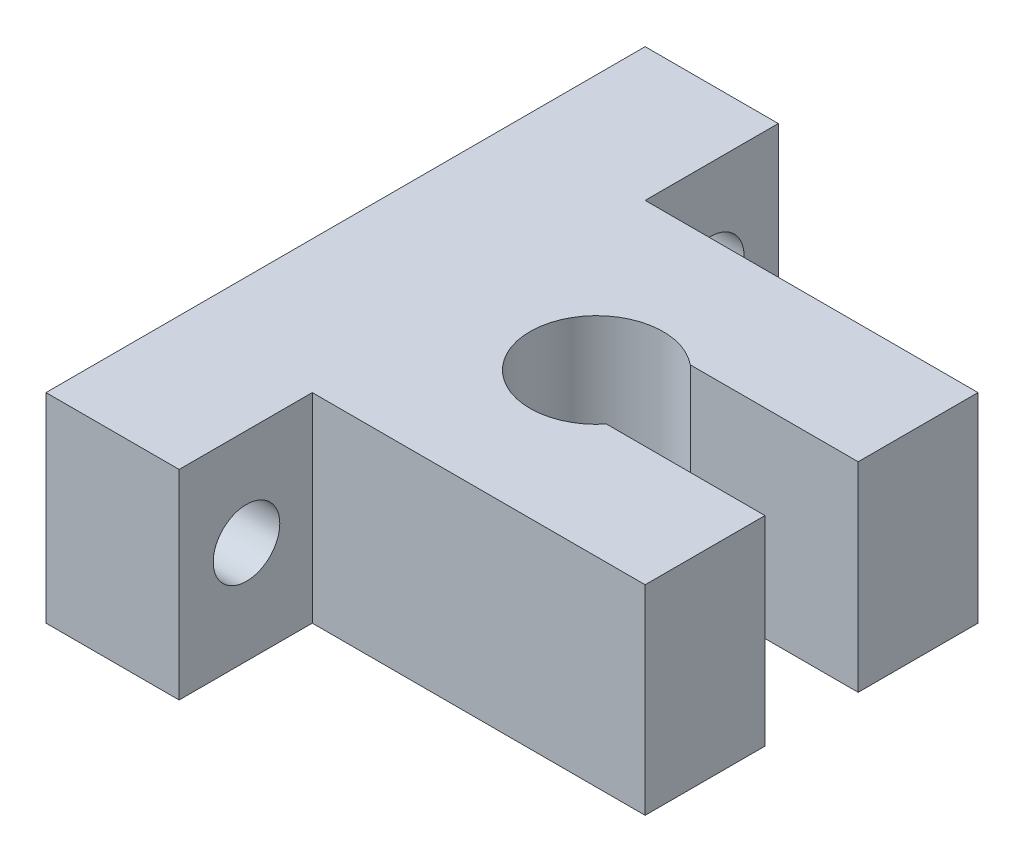
ISO-10303-21;
HEADER;
FILE_DESCRIPTION(('STEP AP214'),'2;1');
FILE_NAME('part.step','',(''),(''),'','','');
FILE_SCHEMA(('AUTOMOTIVE_DESIGN { 1 0 10303 214 1 1 1 1 }'));
ENDSEC;
DATA;
#1=APPLICATION_CONTEXT('core data for automotive mechanical design processes');
#2=APPLICATION_PROTOCOL_DEFINITION('international standard','automotive_design',2000,#1);
#3=PRODUCT_CONTEXT('',#1,'mechanical');
#4=PRODUCT('Part','Part','',(#3));
#5=PRODUCT_RELATED_PRODUCT_CATEGORY('part','',(#4));
#6=PRODUCT_DEFINITION_FORMATION('','',#4);
#7=PRODUCT_DEFINITION_CONTEXT('part definition',#1,'design');
#8=PRODUCT_DEFINITION('design','',#6,#7);
#9=PRODUCT_DEFINITION_SHAPE('','',#8);
#10=(LENGTH_UNIT() NAMED_UNIT(*) SI_UNIT(.MILLI.,.METRE.));
#11=(NAMED_UNIT(*) PLANE_ANGLE_UNIT() SI_UNIT($,.RADIAN.));
#12=(NAMED_UNIT(*) SI_UNIT($,.STERADIAN.) SOLID_ANGLE_UNIT());
#13=UNCERTAINTY_MEASURE_WITH_UNIT(LENGTH_MEASURE(1.E-05),#10,'distance_accuracy_value','');
#14=(GEOMETRIC_REPRESENTATION_CONTEXT(3) GLOBAL_UNCERTAINTY_ASSIGNED_CONTEXT((#13)) GLOBAL_UNIT_ASSIGNED_CONTEXT((#10,
#11,#12)) REPRESENTATION_CONTEXT('',''));
#15=CARTESIAN_POINT('',(0.,0.,0.));
#16=DIRECTION('',(0.,0.,1.));
#17=DIRECTION('',(1.,0.,0.));
#18=AXIS2_PLACEMENT_3D('',#15,#16,#17);
#19=CARTESIAN_POINT('',(10.,15.,-22.8563395641387));
#20=DIRECTION('',(0.,0.,1.));
#21=DIRECTION('',(1.,0.,0.));
#22=AXIS2_PLACEMENT_3D('',#19,#20,#21);
#23=PLANE('',#22);
#24=DIRECTION('',(-1.,0.,0.));
#25=VECTOR('',#24,1.);
#26=CARTESIAN_POINT('',(10.,0.,-22.8563395641387));
#27=LINE('',#26,#25);
#28=CARTESIAN_POINT('',(10.,0.,-22.8563395641387));
#29=VERTEX_POINT('',#28);
#30=CARTESIAN_POINT('',(0.,0.,-22.8563395641387));
#31=VERTEX_POINT('',#30);
#32=EDGE_CURVE('E164',#29,#31,#27,.T.);
#33=ORIENTED_EDGE('',*,*,#32,.T.);
#34=DIRECTION('',(0.,-1.,0.));
#35=VECTOR('',#34,1.);
#36=CARTESIAN_POINT('',(0.,15.,-22.8563395641387));
#37=LINE('',#36,#35);
#38=CARTESIAN_POINT('',(0.,15.,-22.8563395641387));
#39=VERTEX_POINT('',#38);
#40=EDGE_CURVE('E11',#39,#31,#37,.T.);
#41=ORIENTED_EDGE('',*,*,#40,.F.);
#42=DIRECTION('',(-1.,0.,0.));
#43=VECTOR('',#42,1.);
#44=CARTESIAN_POINT('',(10.,15.,-22.8563395641387));
#45=LINE('',#44,#43);
#46=CARTESIAN_POINT('',(10.,15.,-22.8563395641387));
#47=VERTEX_POINT('',#46);
#48=EDGE_CURVE('E199',#47,#39,#45,.T.);
#49=ORIENTED_EDGE('',*,*,#48,.F.);
#50=DIRECTION('',(0.,-1.,0.));
#51=VECTOR('',#50,1.);
#52=CARTESIAN_POINT('',(10.,15.,-22.8563395641387));
#53=LINE('',#52,#51);
#54=EDGE_CURVE('E160',#47,#29,#53,.T.);
#55=ORIENTED_EDGE('',*,*,#54,.T.);
#56=EDGE_LOOP('',(#33,#41,#49,#55));
#57=FACE_BOUND('',#56,.T.);
#58=ADVANCED_FACE('F39',(#57),#23,.F.);
#59=CARTESIAN_POINT('',(0.,15.,-22.8563395641387));
#60=DIRECTION('',(1.,0.,0.));
#61=DIRECTION('',(0.,0.,-1.));
#62=AXIS2_PLACEMENT_3D('',#59,#60,#61);
#63=PLANE('',#62);
#64=CARTESIAN_POINT('',(0.,7.69733450515986,17.0852233610326));
#65=DIRECTION('',(1.,0.,0.));
#66=DIRECTION('',(0.,0.,-1.));
#67=AXIS2_PLACEMENT_3D('',#64,#65,#66);
#68=CIRCLE('',#67,2.5);
#69=CARTESIAN_POINT('',(0.,7.69733450515986,14.5852233610326));
#70=VERTEX_POINT('',#69);
#71=EDGE_CURVE('E169',#70,#70,#68,.T.);
#72=ORIENTED_EDGE('',*,*,#71,.T.);
#73=EDGE_LOOP('',(#72));
#74=FACE_BOUND('',#73,.T.);
#75=CARTESIAN_POINT('',(0.,7.69733450515986,-17.7833246826218));
#76=DIRECTION('',(1.,0.,0.));
#77=DIRECTION('',(0.,0.,-1.));
#78=AXIS2_PLACEMENT_3D('',#75,#76,#77);
#79=CIRCLE('',#78,2.5);
#80=CARTESIAN_POINT('',(0.,7.69733450515986,-20.2833246826218));
#81=VERTEX_POINT('',#80);
#82=EDGE_CURVE('E393',#81,#81,#79,.T.);
#83=ORIENTED_EDGE('',*,*,#82,.T.);
#84=EDGE_LOOP('',(#83));
#85=FACE_BOUND('',#84,.T.);
#86=DIRECTION('',(0.,0.,1.));
#87=VECTOR('',#86,1.);
#88=CARTESIAN_POINT('',(0.,0.,-22.8563395641387));
#89=LINE('',#88,#87);
#90=CARTESIAN_POINT('',(0.,0.,22.1436604358613));
#91=VERTEX_POINT('',#90);
#92=EDGE_CURVE('E168',#31,#91,#89,.T.);
#93=ORIENTED_EDGE('',*,*,#92,.T.);
#94=DIRECTION('',(0.,-1.,0.));
#95=VECTOR('',#94,1.);
#96=CARTESIAN_POINT('',(0.,15.,22.1436604358613));
#97=LINE('',#96,#95);
#98=CARTESIAN_POINT('',(0.,15.,22.1436604358613));
#99=VERTEX_POINT('',#98);
#100=EDGE_CURVE('E48',#99,#91,#97,.T.);
#101=ORIENTED_EDGE('',*,*,#100,.F.);
#102=DIRECTION('',(0.,0.,1.));
#103=VECTOR('',#102,1.);
#104=CARTESIAN_POINT('',(0.,15.,-22.8563395641387));
#105=LINE('',#104,#103);
#106=EDGE_CURVE('E111',#39,#99,#105,.T.);
#107=ORIENTED_EDGE('',*,*,#106,.F.);
#108=ORIENTED_EDGE('',*,*,#40,.T.);
#109=EDGE_LOOP('',(#93,#101,#107,#108));
#110=FACE_BOUND('',#109,.T.);
#111=ADVANCED_FACE('F295',(#74,#85,#110),#63,.F.);
#112=CARTESIAN_POINT('',(0.,15.,22.1436604358613));
#113=DIRECTION('',(0.,0.,-1.));
#114=DIRECTION('',(-1.,0.,0.));
#115=AXIS2_PLACEMENT_3D('',#112,#113,#114);
#116=PLANE('',#115);
#117=DIRECTION('',(1.,0.,0.));
#118=VECTOR('',#117,1.);
#119=CARTESIAN_POINT('',(0.,0.,22.1436604358613));
#120=LINE('',#119,#118);
#121=CARTESIAN_POINT('',(10.,0.,22.1436604358613));
#122=VERTEX_POINT('',#121);
#123=EDGE_CURVE('E172',#91,#122,#120,.T.);
#124=ORIENTED_EDGE('',*,*,#123,.T.);
#125=DIRECTION('',(0.,-1.,0.));
#126=VECTOR('',#125,1.);
#127=CARTESIAN_POINT('',(10.,15.,22.1436604358613));
#128=LINE('',#127,#126);
#129=CARTESIAN_POINT('',(10.,15.,22.1436604358613));
#130=VERTEX_POINT('',#129);
#131=EDGE_CURVE('E226',#130,#122,#128,.T.);
#132=ORIENTED_EDGE('',*,*,#131,.F.);
#133=DIRECTION('',(1.,0.,0.));
#134=VECTOR('',#133,1.);
#135=CARTESIAN_POINT('',(0.,15.,22.1436604358613));
#136=LINE('',#135,#134);
#137=EDGE_CURVE('E236',#99,#130,#136,.T.);
#138=ORIENTED_EDGE('',*,*,#137,.F.);
#139=ORIENTED_EDGE('',*,*,#100,.T.);
#140=EDGE_LOOP('',(#124,#132,#138,#139));
#141=FACE_BOUND('',#140,.T.);
#142=ADVANCED_FACE('F234',(#141),#116,.F.);
#143=CARTESIAN_POINT('',(10.,15.,22.1436604358613));
#144=DIRECTION('',(-1.,0.,0.));
#145=DIRECTION('',(0.,0.,1.));
#146=AXIS2_PLACEMENT_3D('',#143,#144,#145);
#147=PLANE('',#146);
#148=CARTESIAN_POINT('',(10.,7.69733450515986,17.0852233610326));
#149=DIRECTION('',(1.,0.,0.));
#150=DIRECTION('',(0.,0.,-1.));
#151=AXIS2_PLACEMENT_3D('',#148,#149,#150);
#152=CIRCLE('',#151,2.5);
#153=CARTESIAN_POINT('',(10.,7.69733450515986,14.5852233610326));
#154=VERTEX_POINT('',#153);
#155=EDGE_CURVE('E391',#154,#154,#152,.T.);
#156=ORIENTED_EDGE('',*,*,#155,.F.);
#157=EDGE_LOOP('',(#156));
#158=FACE_BOUND('',#157,.T.);
#159=DIRECTION('',(0.,0.,-1.));
#160=VECTOR('',#159,1.);
#161=CARTESIAN_POINT('',(10.,0.,22.1436604358613));
#162=LINE('',#161,#160);
#163=CARTESIAN_POINT('',(10.,0.,12.1436604358613));
#164=VERTEX_POINT('',#163);
#165=EDGE_CURVE('E175',#122,#164,#162,.T.);
#166=ORIENTED_EDGE('',*,*,#165,.T.);
#167=DIRECTION('',(0.,-1.,0.));
#168=VECTOR('',#167,1.);
#169=CARTESIAN_POINT('',(10.,15.,12.1436604358613));
#170=LINE('',#169,#168);
#171=CARTESIAN_POINT('',(10.,15.,12.1436604358613));
#172=VERTEX_POINT('',#171);
#173=EDGE_CURVE('E222',#172,#164,#170,.T.);
#174=ORIENTED_EDGE('',*,*,#173,.F.);
#175=DIRECTION('',(0.,0.,-1.));
#176=VECTOR('',#175,1.);
#177=CARTESIAN_POINT('',(10.,15.,22.1436604358613));
#178=LINE('',#177,#176);
#179=EDGE_CURVE('E255',#130,#172,#178,.T.);
#180=ORIENTED_EDGE('',*,*,#179,.F.);
#181=ORIENTED_EDGE('',*,*,#131,.T.);
#182=EDGE_LOOP('',(#166,#174,#180,#181));
#183=FACE_BOUND('',#182,.T.);
#184=ADVANCED_FACE('F245',(#158,#183),#147,.F.);
#185=CARTESIAN_POINT('',(10.,15.,12.1436604358613));
#186=DIRECTION('',(0.,0.,-1.));
#187=DIRECTION('',(-1.,0.,0.));
#188=AXIS2_PLACEMENT_3D('',#185,#186,#187);
#189=PLANE('',#188);
#190=DIRECTION('',(1.,0.,0.));
#191=VECTOR('',#190,1.);
#192=CARTESIAN_POINT('',(10.,0.,12.1436604358613));
#193=LINE('',#192,#191);
#194=CARTESIAN_POINT('',(35.,0.,12.1436604358613));
#195=VERTEX_POINT('',#194);
#196=EDGE_CURVE('E178',#164,#195,#193,.T.);
#197=ORIENTED_EDGE('',*,*,#196,.T.);
#198=DIRECTION('',(0.,-1.,0.));
#199=VECTOR('',#198,1.);
#200=CARTESIAN_POINT('',(35.,15.,12.1436604358613));
#201=LINE('',#200,#199);
#202=CARTESIAN_POINT('',(35.,15.,12.1436604358613));
#203=VERTEX_POINT('',#202);
#204=EDGE_CURVE('E218',#203,#195,#201,.T.);
#205=ORIENTED_EDGE('',*,*,#204,.F.);
#206=DIRECTION('',(1.,0.,0.));
#207=VECTOR('',#206,1.);
#208=CARTESIAN_POINT('',(10.,15.,12.1436604358613));
#209=LINE('',#208,#207);
#210=EDGE_CURVE('E251',#172,#203,#209,.T.);
#211=ORIENTED_EDGE('',*,*,#210,.F.);
#212=ORIENTED_EDGE('',*,*,#173,.T.);
#213=EDGE_LOOP('',(#197,#205,#211,#212));
#214=FACE_BOUND('',#213,.T.);
#215=ADVANCED_FACE('F249',(#214),#189,.F.);
#216=CARTESIAN_POINT('',(35.,15.,12.1436604358613));
#217=DIRECTION('',(-1.,0.,0.));
#218=DIRECTION('',(0.,0.,1.));
#219=AXIS2_PLACEMENT_3D('',#216,#217,#218);
#220=PLANE('',#219);
#221=DIRECTION('',(0.,0.,-1.));
#222=VECTOR('',#221,1.);
#223=CARTESIAN_POINT('',(35.,0.,12.1436604358613));
#224=LINE('',#223,#222);
#225=CARTESIAN_POINT('',(35.,0.,3.14366043586132));
#226=VERTEX_POINT('',#225);
#227=EDGE_CURVE('E181',#195,#226,#224,.T.);
#228=ORIENTED_EDGE('',*,*,#227,.T.);
#229=DIRECTION('',(0.,-1.,0.));
#230=VECTOR('',#229,1.);
#231=CARTESIAN_POINT('',(35.,15.,3.14366043586132));
#232=LINE('',#231,#230);
#233=CARTESIAN_POINT('',(35.,15.,3.14366043586132));
#234=VERTEX_POINT('',#233);
#235=EDGE_CURVE('E214',#234,#226,#232,.T.);
#236=ORIENTED_EDGE('',*,*,#235,.F.);
#237=DIRECTION('',(0.,0.,-1.));
#238=VECTOR('',#237,1.);
#239=CARTESIAN_POINT('',(35.,15.,12.1436604358613));
#240=LINE('',#239,#238);
#241=EDGE_CURVE('E254',#203,#234,#240,.T.);
#242=ORIENTED_EDGE('',*,*,#241,.F.);
#243=ORIENTED_EDGE('',*,*,#204,.T.);
#244=EDGE_LOOP('',(#228,#236,#242,#243));
#245=FACE_BOUND('',#244,.T.);
#246=ADVANCED_FACE('F312',(#245),#220,.F.);
#247=CARTESIAN_POINT('',(35.,15.,3.14366043586132));
#248=DIRECTION('',(0.,0.,1.));
#249=DIRECTION('',(1.,0.,0.));
#250=AXIS2_PLACEMENT_3D('',#247,#248,#249);
#251=PLANE('',#250);
#252=DIRECTION('',(-1.,0.,0.));
#253=VECTOR('',#252,1.);
#254=CARTESIAN_POINT('',(35.,0.,3.14366043586132));
#255=LINE('',#254,#253);
#256=CARTESIAN_POINT('',(23.0952406706143,0.,3.14366043586132));
#257=VERTEX_POINT('',#256);
#258=EDGE_CURVE('E184',#226,#257,#255,.T.);
#259=ORIENTED_EDGE('',*,*,#258,.T.);
#260=DIRECTION('',(0.,-1.,0.));
#261=VECTOR('',#260,1.);
#262=CARTESIAN_POINT('',(23.0952406706143,15.,3.14366043586132));
#263=LINE('',#262,#261);
#264=CARTESIAN_POINT('',(23.0952406706143,15.,3.14366043586132));
#265=VERTEX_POINT('',#264);
#266=EDGE_CURVE('E210',#265,#257,#263,.T.);
#267=ORIENTED_EDGE('',*,*,#266,.F.);
#268=DIRECTION('',(-1.,0.,0.));
#269=VECTOR('',#268,1.);
#270=CARTESIAN_POINT('',(35.,15.,3.14366043586132));
#271=LINE('',#270,#269);
#272=EDGE_CURVE('E259',#234,#265,#271,.T.);
#273=ORIENTED_EDGE('',*,*,#272,.F.);
#274=ORIENTED_EDGE('',*,*,#235,.T.);
#275=EDGE_LOOP('',(#259,#267,#273,#274));
#276=FACE_BOUND('',#275,.T.);
#277=ADVANCED_FACE('F315',(#276),#251,.F.);
#278=CARTESIAN_POINT('',(19.2071307102351,15.,0.));
#279=DIRECTION('',(0.,-1.,0.));
#280=DIRECTION('',(0.,0.,-1.));
#281=AXIS2_PLACEMENT_3D('',#278,#279,#280);
#282=CYLINDRICAL_SURFACE('',#281,5.);
#283=CARTESIAN_POINT('',(19.2071307102351,0.,0.));
#284=DIRECTION('',(0.,-1.,0.));
#285=DIRECTION('',(0.,0.,1.));
#286=AXIS2_PLACEMENT_3D('',#283,#284,#285);
#287=CIRCLE('',#286,5.);
#288=CARTESIAN_POINT('',(22.3896839566174,0.,-3.85633956413869));
#289=VERTEX_POINT('',#288);
#290=EDGE_CURVE('E187',#257,#289,#287,.T.);
#291=ORIENTED_EDGE('',*,*,#290,.T.);
#292=DIRECTION('',(0.,-1.,0.));
#293=VECTOR('',#292,1.);
#294=CARTESIAN_POINT('',(22.3896839566174,15.,-3.85633956413869));
#295=LINE('',#294,#293);
#296=CARTESIAN_POINT('',(22.3896839566174,15.,-3.85633956413869));
#297=VERTEX_POINT('',#296);
#298=EDGE_CURVE('E206',#297,#289,#295,.T.);
#299=ORIENTED_EDGE('',*,*,#298,.F.);
#300=CARTESIAN_POINT('',(19.2071307102351,15.,0.));
#301=DIRECTION('',(0.,-1.,0.));
#302=DIRECTION('',(0.,0.,1.));
#303=AXIS2_PLACEMENT_3D('',#300,#301,#302);
#304=CIRCLE('',#303,5.);
#305=EDGE_CURVE('E266',#265,#297,#304,.T.);
#306=ORIENTED_EDGE('',*,*,#305,.F.);
#307=ORIENTED_EDGE('',*,*,#266,.T.);
#308=EDGE_LOOP('',(#291,#299,#306,#307));
#309=FACE_BOUND('',#308,.T.);
#310=ADVANCED_FACE('F274',(#309),#282,.F.);
#311=CARTESIAN_POINT('',(35.,15.,-3.85633956413869));
#312=DIRECTION('',(0.,0.,-1.));
#313=DIRECTION('',(-1.,0.,0.));
#314=AXIS2_PLACEMENT_3D('',#311,#312,#313);
#315=PLANE('',#314);
#316=DIRECTION('',(1.,0.,0.));
#317=VECTOR('',#316,1.);
#318=CARTESIAN_POINT('',(35.,0.,-3.85633956413869));
#319=LINE('',#318,#317);
#320=CARTESIAN_POINT('',(35.,0.,-3.85633956413869));
#321=VERTEX_POINT('',#320);
#322=EDGE_CURVE('E190',#289,#321,#319,.T.);
#323=ORIENTED_EDGE('',*,*,#322,.T.);
#324=DIRECTION('',(0.,-1.,0.));
#325=VECTOR('',#324,1.);
#326=CARTESIAN_POINT('',(35.,15.,-3.85633956413869));
#327=LINE('',#326,#325);
#328=CARTESIAN_POINT('',(35.,15.,-3.85633956413869));
#329=VERTEX_POINT('',#328);
#330=EDGE_CURVE('E153',#329,#321,#327,.T.);
#331=ORIENTED_EDGE('',*,*,#330,.F.);
#332=DIRECTION('',(1.,0.,0.));
#333=VECTOR('',#332,1.);
#334=CARTESIAN_POINT('',(35.,15.,-3.85633956413869));
#335=LINE('',#334,#333);
#336=EDGE_CURVE('E142',#297,#329,#335,.T.);
#337=ORIENTED_EDGE('',*,*,#336,.F.);
#338=ORIENTED_EDGE('',*,*,#298,.T.);
#339=EDGE_LOOP('',(#323,#331,#337,#338));
#340=FACE_BOUND('',#339,.T.);
#341=ADVANCED_FACE('F278',(#340),#315,.F.);
#342=CARTESIAN_POINT('',(35.,15.,-3.85633956413869));
#343=DIRECTION('',(-1.,0.,0.));
#344=DIRECTION('',(0.,0.,1.));
#345=AXIS2_PLACEMENT_3D('',#342,#343,#344);
#346=PLANE('',#345);
#347=DIRECTION('',(0.,0.,-1.));
#348=VECTOR('',#347,1.);
#349=CARTESIAN_POINT('',(35.,0.,-3.85633956413869));
#350=LINE('',#349,#348);
#351=CARTESIAN_POINT('',(35.,0.,-12.8563395641387));
#352=VERTEX_POINT('',#351);
#353=EDGE_CURVE('E151',#321,#352,#350,.T.);
#354=ORIENTED_EDGE('',*,*,#353,.T.);
#355=DIRECTION('',(0.,-1.,0.));
#356=VECTOR('',#355,1.);
#357=CARTESIAN_POINT('',(35.,15.,-12.8563395641387));
#358=LINE('',#357,#356);
#359=CARTESIAN_POINT('',(35.,15.,-12.8563395641387));
#360=VERTEX_POINT('',#359);
#361=EDGE_CURVE('E148',#360,#352,#358,.T.);
#362=ORIENTED_EDGE('',*,*,#361,.F.);
#363=DIRECTION('',(0.,0.,-1.));
#364=VECTOR('',#363,1.);
#365=CARTESIAN_POINT('',(35.,15.,-3.85633956413869));
#366=LINE('',#365,#364);
#367=EDGE_CURVE('E136',#329,#360,#366,.T.);
#368=ORIENTED_EDGE('',*,*,#367,.F.);
#369=ORIENTED_EDGE('',*,*,#330,.T.);
#370=EDGE_LOOP('',(#354,#362,#368,#369));
#371=FACE_BOUND('',#370,.T.);
#372=ADVANCED_FACE('F149',(#371),#346,.F.);
#373=CARTESIAN_POINT('',(35.,15.,-12.8563395641387));
#374=DIRECTION('',(0.,0.,1.));
#375=DIRECTION('',(1.,0.,0.));
#376=AXIS2_PLACEMENT_3D('',#373,#374,#375);
#377=PLANE('',#376);
#378=DIRECTION('',(-1.,0.,0.));
#379=VECTOR('',#378,1.);
#380=CARTESIAN_POINT('',(35.,0.,-12.8563395641387));
#381=LINE('',#380,#379);
#382=CARTESIAN_POINT('',(10.,0.,-12.8563395641387));
#383=VERTEX_POINT('',#382);
#384=EDGE_CURVE('E97',#352,#383,#381,.T.);
#385=ORIENTED_EDGE('',*,*,#384,.T.);
#386=DIRECTION('',(0.,-1.,0.));
#387=VECTOR('',#386,1.);
#388=CARTESIAN_POINT('',(10.,15.,-12.8563395641387));
#389=LINE('',#388,#387);
#390=CARTESIAN_POINT('',(10.,15.,-12.8563395641387));
#391=VERTEX_POINT('',#390);
#392=EDGE_CURVE('E154',#391,#383,#389,.T.);
#393=ORIENTED_EDGE('',*,*,#392,.F.);
#394=DIRECTION('',(-1.,0.,0.));
#395=VECTOR('',#394,1.);
#396=CARTESIAN_POINT('',(35.,15.,-12.8563395641387));
#397=LINE('',#396,#395);
#398=EDGE_CURVE('E140',#360,#391,#397,.T.);
#399=ORIENTED_EDGE('',*,*,#398,.F.);
#400=ORIENTED_EDGE('',*,*,#361,.T.);
#401=EDGE_LOOP('',(#385,#393,#399,#400));
#402=FACE_BOUND('',#401,.T.);
#403=ADVANCED_FACE('F156',(#402),#377,.F.);
#404=CARTESIAN_POINT('',(10.,15.,-12.8563395641387));
#405=DIRECTION('',(-1.,0.,0.));
#406=DIRECTION('',(0.,0.,1.));
#407=AXIS2_PLACEMENT_3D('',#404,#405,#406);
#408=PLANE('',#407);
#409=CARTESIAN_POINT('',(10.,7.69733450515986,-17.7833246826218));
#410=DIRECTION('',(1.,0.,0.));
#411=DIRECTION('',(0.,0.,-1.));
#412=AXIS2_PLACEMENT_3D('',#409,#410,#411);
#413=CIRCLE('',#412,2.5);
#414=CARTESIAN_POINT('',(10.,7.69733450515986,-20.2833246826218));
#415=VERTEX_POINT('',#414);
#416=EDGE_CURVE('E399',#415,#415,#413,.T.);
#417=ORIENTED_EDGE('',*,*,#416,.F.);
#418=EDGE_LOOP('',(#417));
#419=FACE_BOUND('',#418,.T.);
#420=DIRECTION('',(0.,0.,-1.));
#421=VECTOR('',#420,1.);
#422=CARTESIAN_POINT('',(10.,0.,-12.8563395641387));
#423=LINE('',#422,#421);
#424=EDGE_CURVE('E103',#383,#29,#423,.T.);
#425=ORIENTED_EDGE('',*,*,#424,.T.);
#426=ORIENTED_EDGE('',*,*,#54,.F.);
#427=DIRECTION('',(0.,0.,-1.));
#428=VECTOR('',#427,1.);
#429=CARTESIAN_POINT('',(10.,15.,-12.8563395641387));
#430=LINE('',#429,#428);
#431=EDGE_CURVE('E56',#391,#47,#430,.T.);
#432=ORIENTED_EDGE('',*,*,#431,.F.);
#433=ORIENTED_EDGE('',*,*,#392,.T.);
#434=EDGE_LOOP('',(#425,#426,#432,#433));
#435=FACE_BOUND('',#434,.T.);
#436=ADVANCED_FACE('F282',(#419,#435),#408,.F.);
#437=CARTESIAN_POINT('',(19.2071307102351,15.,0.));
#438=DIRECTION('',(0.,1.,0.));
#439=DIRECTION('',(0.,0.,1.));
#440=AXIS2_PLACEMENT_3D('',#437,#438,#439);
#441=PLANE('',#440);
#442=ORIENTED_EDGE('',*,*,#48,.T.);
#443=ORIENTED_EDGE('',*,*,#106,.T.);
#444=ORIENTED_EDGE('',*,*,#137,.T.);
#445=ORIENTED_EDGE('',*,*,#179,.T.);
#446=ORIENTED_EDGE('',*,*,#210,.T.);
#447=ORIENTED_EDGE('',*,*,#241,.T.);
#448=ORIENTED_EDGE('',*,*,#272,.T.);
#449=ORIENTED_EDGE('',*,*,#305,.T.);
#450=ORIENTED_EDGE('',*,*,#336,.T.);
#451=ORIENTED_EDGE('',*,*,#367,.T.);
#452=ORIENTED_EDGE('',*,*,#398,.T.);
#453=ORIENTED_EDGE('',*,*,#431,.T.);
#454=EDGE_LOOP('',(#442,#443,#444,#445,#446,#447,#448,#449,#450,#451,#452,#453));
#455=FACE_BOUND('',#454,.T.);
#456=ADVANCED_FACE('F138',(#455),#441,.T.);
#457=CARTESIAN_POINT('',(19.2071307102351,0.,0.));
#458=DIRECTION('',(0.,1.,0.));
#459=DIRECTION('',(0.,0.,1.));
#460=AXIS2_PLACEMENT_3D('',#457,#458,#459);
#461=PLANE('',#460);
#462=ORIENTED_EDGE('',*,*,#32,.F.);
#463=ORIENTED_EDGE('',*,*,#424,.F.);
#464=ORIENTED_EDGE('',*,*,#384,.F.);
#465=ORIENTED_EDGE('',*,*,#353,.F.);
#466=ORIENTED_EDGE('',*,*,#322,.F.);
#467=ORIENTED_EDGE('',*,*,#290,.F.);
#468=ORIENTED_EDGE('',*,*,#258,.F.);
#469=ORIENTED_EDGE('',*,*,#227,.F.);
#470=ORIENTED_EDGE('',*,*,#196,.F.);
#471=ORIENTED_EDGE('',*,*,#165,.F.);
#472=ORIENTED_EDGE('',*,*,#123,.F.);
#473=ORIENTED_EDGE('',*,*,#92,.F.);
#474=EDGE_LOOP('',(#462,#463,#464,#465,#466,#467,#468,#469,#470,#471,#472,#473));
#475=FACE_BOUND('',#474,.T.);
#476=ADVANCED_FACE('F240',(#475),#461,.F.);
#477=CARTESIAN_POINT('',(0.,7.69733450515986,-17.7833246826218));
#478=DIRECTION('',(1.,0.,0.));
#479=DIRECTION('',(0.,0.,-1.));
#480=AXIS2_PLACEMENT_3D('',#477,#478,#479);
#481=CYLINDRICAL_SURFACE('',#480,2.5);
#482=ORIENTED_EDGE('',*,*,#82,.F.);
#483=EDGE_LOOP('',(#482));
#484=FACE_BOUND('',#483,.T.);
#485=ORIENTED_EDGE('',*,*,#416,.T.);
#486=EDGE_LOOP('',(#485));
#487=FACE_BOUND('',#486,.T.);
#488=ADVANCED_FACE('F348',(#484,#487),#481,.F.);
#489=CARTESIAN_POINT('',(0.,7.69733450515986,17.0852233610326));
#490=DIRECTION('',(1.,0.,0.));
#491=DIRECTION('',(0.,0.,-1.));
#492=AXIS2_PLACEMENT_3D('',#489,#490,#491);
#493=CYLINDRICAL_SURFACE('',#492,2.5);
#494=ORIENTED_EDGE('',*,*,#71,.F.);
#495=EDGE_LOOP('',(#494));
#496=FACE_BOUND('',#495,.T.);
#497=ORIENTED_EDGE('',*,*,#155,.T.);
#498=EDGE_LOOP('',(#497));
#499=FACE_BOUND('',#498,.T.);
#500=ADVANCED_FACE('F373',(#496,#499),#493,.F.);
#501=CLOSED_SHELL('',(#58,#111,#142,#184,#215,#246,#277,#310,#341,#372,#403,#436,#456,#476,#488,#500));
#502=MANIFOLD_SOLID_BREP('B2',#501);
#503=ADVANCED_BREP_SHAPE_REPRESENTATION('',(#18,#502),#14);
#504=SHAPE_DEFINITION_REPRESENTATION(#9,#503);
ENDSEC;
END-ISO-10303-21;
